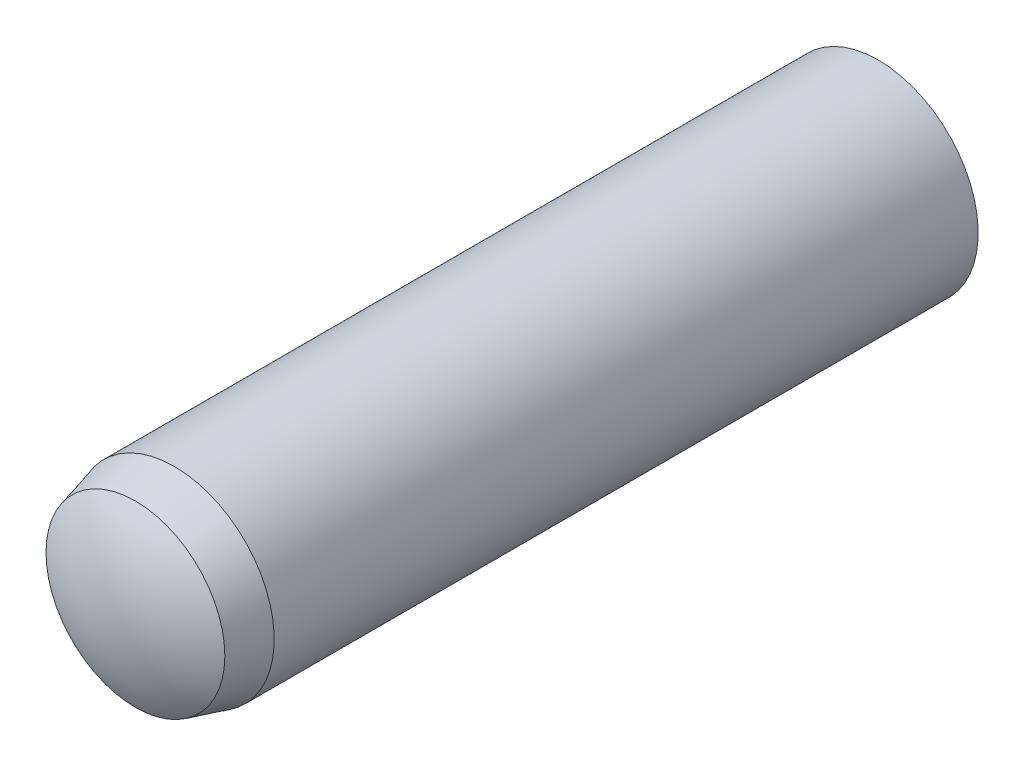
ISO-10303-21;
HEADER;
FILE_DESCRIPTION(('STEP AP214'),'2;1');
FILE_NAME('part.step','',(''),(''),'','','');
FILE_SCHEMA(('AUTOMOTIVE_DESIGN { 1 0 10303 214 1 1 1 1 }'));
ENDSEC;
DATA;
#1=APPLICATION_CONTEXT('core data for automotive mechanical design processes');
#2=APPLICATION_PROTOCOL_DEFINITION('international standard','automotive_design',2000,#1);
#3=PRODUCT_CONTEXT('',#1,'mechanical');
#4=PRODUCT('Part','Part','',(#3));
#5=PRODUCT_RELATED_PRODUCT_CATEGORY('part','',(#4));
#6=PRODUCT_DEFINITION_FORMATION('','',#4);
#7=PRODUCT_DEFINITION_CONTEXT('part definition',#1,'design');
#8=PRODUCT_DEFINITION('design','',#6,#7);
#9=PRODUCT_DEFINITION_SHAPE('','',#8);
#10=(LENGTH_UNIT() NAMED_UNIT(*) SI_UNIT(.MILLI.,.METRE.));
#11=(NAMED_UNIT(*) PLANE_ANGLE_UNIT() SI_UNIT($,.RADIAN.));
#12=(NAMED_UNIT(*) SI_UNIT($,.STERADIAN.) SOLID_ANGLE_UNIT());
#13=UNCERTAINTY_MEASURE_WITH_UNIT(LENGTH_MEASURE(1.E-05),#10,'distance_accuracy_value','');
#14=(GEOMETRIC_REPRESENTATION_CONTEXT(3) GLOBAL_UNCERTAINTY_ASSIGNED_CONTEXT((#13)) GLOBAL_UNIT_ASSIGNED_CONTEXT((#10,
#11,#12)) REPRESENTATION_CONTEXT('',''));
#15=CARTESIAN_POINT('',(0.,0.,0.));
#16=DIRECTION('',(0.,0.,1.));
#17=DIRECTION('',(1.,0.,0.));
#18=AXIS2_PLACEMENT_3D('',#15,#16,#17);
#19=CARTESIAN_POINT('',(0.,0.,-3.27500000000002));
#20=DIRECTION('',(0.,0.,1.));
#21=DIRECTION('',(0.,-1.,0.));
#22=AXIS2_PLACEMENT_3D('',#19,#20,#21);
#23=SPHERICAL_SURFACE('',#22,2.72499999999998);
#24=CARTESIAN_POINT('',(0.,0.,-5.55));
#25=DIRECTION('',(0.,0.,1.));
#26=DIRECTION('',(0.,-1.,0.));
#27=AXIS2_PLACEMENT_3D('',#24,#25,#26);
#28=CIRCLE('',#27,1.5);
#29=CARTESIAN_POINT('',(0.,-1.5,-5.55));
#30=VERTEX_POINT('',#29);
#31=EDGE_CURVE('E10',#30,#30,#28,.T.);
#32=ORIENTED_EDGE('',*,*,#31,.F.);
#33=EDGE_LOOP('',(#32));
#34=FACE_BOUND('',#33,.T.);
#35=ADVANCED_FACE('F39',(#34),#23,.T.);
#36=CARTESIAN_POINT('',(0.,0.,6.));
#37=DIRECTION('',(0.,0.,1.));
#38=DIRECTION('',(0.,-1.,0.));
#39=AXIS2_PLACEMENT_3D('',#36,#37,#38);
#40=CYLINDRICAL_SURFACE('',#39,1.5);
#41=CARTESIAN_POINT('',(0.,0.,5.025));
#42=DIRECTION('',(0.,0.,1.));
#43=DIRECTION('',(0.,-1.,0.));
#44=AXIS2_PLACEMENT_3D('',#41,#42,#43);
#45=CIRCLE('',#44,1.5);
#46=CARTESIAN_POINT('',(0.,-1.5,5.025));
#47=VERTEX_POINT('',#46);
#48=EDGE_CURVE('E46',#47,#47,#45,.T.);
#49=ORIENTED_EDGE('',*,*,#48,.F.);
#50=EDGE_LOOP('',(#49));
#51=FACE_BOUND('',#50,.T.);
#52=ORIENTED_EDGE('',*,*,#31,.T.);
#53=EDGE_LOOP('',(#52));
#54=FACE_BOUND('',#53,.T.);
#55=ADVANCED_FACE('F66',(#51,#54),#40,.T.);
#56=CARTESIAN_POINT('',(0.,0.,5.025));
#57=DIRECTION('',(0.,0.,-1.));
#58=DIRECTION('',(0.,1.,0.));
#59=AXIS2_PLACEMENT_3D('',#56,#57,#58);
#60=CONICAL_SURFACE('',#59,1.5,0.26179938779915);
#61=CARTESIAN_POINT('',(0.,0.,5.61));
#62=DIRECTION('',(0.,0.,1.));
#63=DIRECTION('',(0.,-1.,0.));
#64=AXIS2_PLACEMENT_3D('',#61,#62,#63);
#65=CIRCLE('',#64,1.34324972242779);
#66=CARTESIAN_POINT('',(0.,-1.34324972242779,5.61));
#67=VERTEX_POINT('',#66);
#68=EDGE_CURVE('E52',#67,#67,#65,.T.);
#69=ORIENTED_EDGE('',*,*,#68,.F.);
#70=EDGE_LOOP('',(#69));
#71=FACE_BOUND('',#70,.T.);
#72=ORIENTED_EDGE('',*,*,#48,.T.);
#73=EDGE_LOOP('',(#72));
#74=FACE_BOUND('',#73,.T.);
#75=ADVANCED_FACE('F64',(#71,#74),#60,.T.);
#76=CARTESIAN_POINT('',(0.,0.,3.49176946563802));
#77=DIRECTION('',(0.,0.,1.));
#78=DIRECTION('',(0.,1.,0.));
#79=AXIS2_PLACEMENT_3D('',#76,#77,#78);
#80=SPHERICAL_SURFACE('',#79,2.50823053436198);
#81=ORIENTED_EDGE('',*,*,#68,.T.);
#82=EDGE_LOOP('',(#81));
#83=FACE_BOUND('',#82,.T.);
#84=ADVANCED_FACE('F62',(#83),#80,.T.);
#85=CLOSED_SHELL('',(#35,#55,#75,#84));
#86=MANIFOLD_SOLID_BREP('B2',#85);
#87=ADVANCED_BREP_SHAPE_REPRESENTATION('',(#18,#86),#14);
#88=SHAPE_DEFINITION_REPRESENTATION(#9,#87);
ENDSEC;
END-ISO-10303-21;
